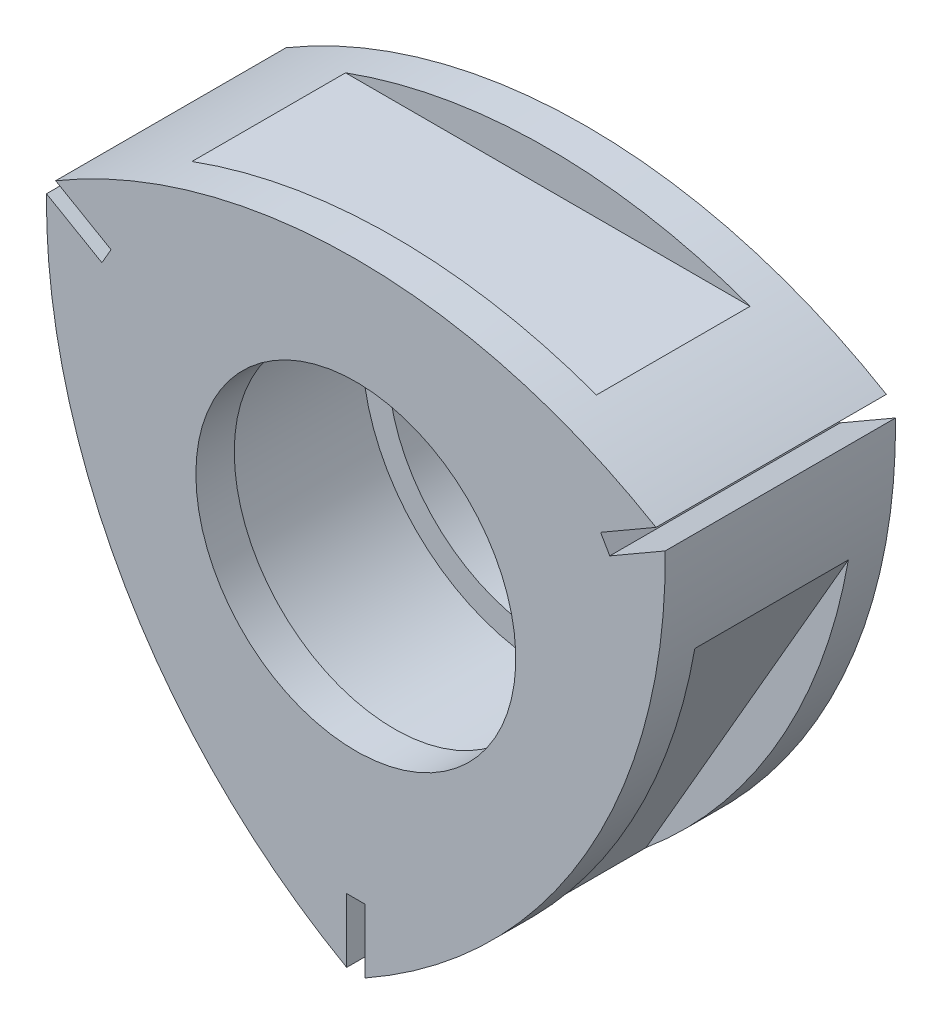
ISO-10303-21;
HEADER;
FILE_DESCRIPTION(('STEP AP214'),'2;1');
FILE_NAME('part.step','',(''),(''),'','','');
FILE_SCHEMA(('AUTOMOTIVE_DESIGN { 1 0 10303 214 1 1 1 1 }'));
ENDSEC;
DATA;
#1=APPLICATION_CONTEXT('core data for automotive mechanical design processes');
#2=APPLICATION_PROTOCOL_DEFINITION('international standard','automotive_design',2000,#1);
#3=PRODUCT_CONTEXT('',#1,'mechanical');
#4=PRODUCT('Part','Part','',(#3));
#5=PRODUCT_RELATED_PRODUCT_CATEGORY('part','',(#4));
#6=PRODUCT_DEFINITION_FORMATION('','',#4);
#7=PRODUCT_DEFINITION_CONTEXT('part definition',#1,'design');
#8=PRODUCT_DEFINITION('design','',#6,#7);
#9=PRODUCT_DEFINITION_SHAPE('','',#8);
#10=(LENGTH_UNIT() NAMED_UNIT(*) SI_UNIT(.MILLI.,.METRE.));
#11=(NAMED_UNIT(*) PLANE_ANGLE_UNIT() SI_UNIT($,.RADIAN.));
#12=(NAMED_UNIT(*) SI_UNIT($,.STERADIAN.) SOLID_ANGLE_UNIT());
#13=UNCERTAINTY_MEASURE_WITH_UNIT(LENGTH_MEASURE(1.E-05),#10,'distance_accuracy_value','');
#14=(GEOMETRIC_REPRESENTATION_CONTEXT(3) GLOBAL_UNCERTAINTY_ASSIGNED_CONTEXT((#13)) GLOBAL_UNIT_ASSIGNED_CONTEXT((#10,
#11,#12)) REPRESENTATION_CONTEXT('',''));
#15=CARTESIAN_POINT('',(0.,0.,0.));
#16=DIRECTION('',(0.,0.,1.));
#17=DIRECTION('',(1.,0.,0.));
#18=AXIS2_PLACEMENT_3D('',#15,#16,#17);
#19=CARTESIAN_POINT('',(-21.8238401753678,12.5999999999999,18.));
#20=DIRECTION('',(0.,0.,1.));
#21=DIRECTION('',(1.,0.,0.));
#22=AXIS2_PLACEMENT_3D('',#19,#20,#21);
#23=PLANE('',#22);
#24=CARTESIAN_POINT('',(-21.8238401753678,12.5999999999999,18.));
#25=DIRECTION('',(0.,0.,1.));
#26=DIRECTION('',(1.,0.,0.));
#27=AXIS2_PLACEMENT_3D('',#24,#25,#26);
#28=CIRCLE('',#27,45.9999999999999);
#29=CARTESIAN_POINT('',(0.71479332358234,-27.5,18.));
#30=VERTEX_POINT('',#29);
#31=CARTESIAN_POINT('',(24.1730952658632,13.1309708233222,18.));
#32=VERTEX_POINT('',#31);
#33=EDGE_CURVE('E249',#30,#32,#28,.T.);
#34=ORIENTED_EDGE('',*,*,#33,.T.);
#35=DIRECTION('',(-0.866025403784425,-0.500000000000023,0.));
#36=VECTOR('',#35,1.);
#37=CARTESIAN_POINT('',(24.1730952658632,13.1309708233222,18.));
#38=LINE('',#37,#36);
#39=CARTESIAN_POINT('',(19.8429682469412,10.6309708233221,18.));
#40=VERTEX_POINT('',#39);
#41=EDGE_CURVE('E247',#32,#40,#38,.T.);
#42=ORIENTED_EDGE('',*,*,#41,.T.);
#43=DIRECTION('',(-0.500000000000077,0.866025403784395,0.));
#44=VECTOR('',#43,1.);
#45=CARTESIAN_POINT('',(19.4855715851499,11.25,18.));
#46=LINE('',#45,#44);
#47=CARTESIAN_POINT('',(19.1281749233587,11.8690291766778,18.));
#48=VERTEX_POINT('',#47);
#49=EDGE_CURVE('E245',#40,#48,#46,.T.);
#50=ORIENTED_EDGE('',*,*,#49,.T.);
#51=DIRECTION('',(0.866025403784439,0.499999999999999,0.));
#52=VECTOR('',#51,1.);
#53=CARTESIAN_POINT('',(23.4583019422809,14.3690291766778,18.));
#54=LINE('',#53,#52);
#55=CARTESIAN_POINT('',(23.4583019422809,14.3690291766778,18.));
#56=VERTEX_POINT('',#55);
#57=EDGE_CURVE('E243',#48,#56,#54,.T.);
#58=ORIENTED_EDGE('',*,*,#57,.T.);
#59=CARTESIAN_POINT('',(0.,-25.2,18.));
#60=DIRECTION('',(0.,0.,1.));
#61=DIRECTION('',(1.,0.,0.));
#62=AXIS2_PLACEMENT_3D('',#59,#60,#61);
#63=CIRCLE('',#62,46.);
#64=CARTESIAN_POINT('',(-23.4583019422809,14.3690291766778,18.));
#65=VERTEX_POINT('',#64);
#66=EDGE_CURVE('E241',#56,#65,#63,.T.);
#67=ORIENTED_EDGE('',*,*,#66,.T.);
#68=DIRECTION('',(0.866025403784438,-0.500000000000002,0.));
#69=VECTOR('',#68,1.);
#70=CARTESIAN_POINT('',(-23.4583019422809,14.3690291766778,18.));
#71=LINE('',#70,#69);
#72=CARTESIAN_POINT('',(-19.1281749233587,11.8690291766778,18.));
#73=VERTEX_POINT('',#72);
#74=EDGE_CURVE('E239',#65,#73,#71,.T.);
#75=ORIENTED_EDGE('',*,*,#74,.T.);
#76=DIRECTION('',(-0.499999999999994,-0.866025403784442,0.));
#77=VECTOR('',#76,1.);
#78=CARTESIAN_POINT('',(-19.4855715833587,11.2500000031024,18.));
#79=LINE('',#78,#77);
#80=CARTESIAN_POINT('',(-19.842968246941,10.6309708233222,18.));
#81=VERTEX_POINT('',#80);
#82=EDGE_CURVE('E237',#73,#81,#79,.T.);
#83=ORIENTED_EDGE('',*,*,#82,.T.);
#84=DIRECTION('',(-0.866025403784439,0.499999999999999,0.));
#85=VECTOR('',#84,1.);
#86=CARTESIAN_POINT('',(-22.181236837159,11.9809708233223,18.));
#87=LINE('',#86,#85);
#88=CARTESIAN_POINT('',(-24.1730952658632,13.1309708233222,18.));
#89=VERTEX_POINT('',#88);
#90=EDGE_CURVE('E235',#81,#89,#87,.T.);
#91=ORIENTED_EDGE('',*,*,#90,.T.);
#92=CARTESIAN_POINT('',(21.8238401753676,12.6,18.));
#93=DIRECTION('',(0.,0.,1.));
#94=DIRECTION('',(-1.,0.,0.));
#95=AXIS2_PLACEMENT_3D('',#92,#93,#94);
#96=CIRCLE('',#95,45.9999999999997);
#97=CARTESIAN_POINT('',(-0.714793323582361,-27.5,18.));
#98=VERTEX_POINT('',#97);
#99=EDGE_CURVE('E233',#89,#98,#96,.T.);
#100=ORIENTED_EDGE('',*,*,#99,.T.);
#101=DIRECTION('',(0.,1.,0.));
#102=VECTOR('',#101,1.);
#103=CARTESIAN_POINT('',(-0.714793323582361,-27.5,18.));
#104=LINE('',#103,#102);
#105=CARTESIAN_POINT('',(-0.714793323582339,-22.5,18.));
#106=VERTEX_POINT('',#105);
#107=EDGE_CURVE('E231',#98,#106,#104,.T.);
#108=ORIENTED_EDGE('',*,*,#107,.T.);
#109=DIRECTION('',(1.,0.,0.));
#110=VECTOR('',#109,1.);
#111=CARTESIAN_POINT('',(0.,-22.5,18.));
#112=LINE('',#111,#110);
#113=CARTESIAN_POINT('',(0.714793323582348,-22.5,18.));
#114=VERTEX_POINT('',#113);
#115=EDGE_CURVE('E229',#106,#114,#112,.T.);
#116=ORIENTED_EDGE('',*,*,#115,.T.);
#117=DIRECTION('',(0.,-1.,0.));
#118=VECTOR('',#117,1.);
#119=CARTESIAN_POINT('',(0.71479332358234,-27.5,18.));
#120=LINE('',#119,#118);
#121=EDGE_CURVE('E227',#114,#30,#120,.T.);
#122=ORIENTED_EDGE('',*,*,#121,.T.);
#123=EDGE_LOOP('',(#34,#42,#50,#58,#67,#75,#83,#91,#100,#108,#116,#122));
#124=FACE_BOUND('',#123,.T.);
#125=CARTESIAN_POINT('',(0.,0.,18.));
#126=DIRECTION('',(0.,0.,-1.));
#127=DIRECTION('',(-1.,0.,0.));
#128=AXIS2_PLACEMENT_3D('',#125,#126,#127);
#129=CIRCLE('',#128,12.5);
#130=CARTESIAN_POINT('',(-12.5,0.,18.));
#131=VERTEX_POINT('',#130);
#132=EDGE_CURVE('E305',#131,#131,#129,.T.);
#133=ORIENTED_EDGE('',*,*,#132,.T.);
#134=EDGE_LOOP('',(#133));
#135=FACE_BOUND('',#134,.T.);
#136=ADVANCED_FACE('F26',(#124,#135),#23,.T.);
#137=CARTESIAN_POINT('',(-21.8238401753678,12.5999999999999,0.));
#138=DIRECTION('',(0.,0.,1.));
#139=DIRECTION('',(1.,0.,0.));
#140=AXIS2_PLACEMENT_3D('',#137,#138,#139);
#141=PLANE('',#140);
#142=CARTESIAN_POINT('',(-21.8238401753679,12.6,0.));
#143=DIRECTION('',(0.,0.,1.));
#144=DIRECTION('',(1.,0.,0.));
#145=AXIS2_PLACEMENT_3D('',#142,#143,#144);
#146=CIRCLE('',#145,46.);
#147=CARTESIAN_POINT('',(0.71479332358234,-27.5,0.));
#148=VERTEX_POINT('',#147);
#149=CARTESIAN_POINT('',(24.1730952658632,13.1309708233222,0.));
#150=VERTEX_POINT('',#149);
#151=EDGE_CURVE('E281',#148,#150,#146,.T.);
#152=ORIENTED_EDGE('',*,*,#151,.F.);
#153=DIRECTION('',(0.,-1.,0.));
#154=VECTOR('',#153,1.);
#155=CARTESIAN_POINT('',(0.71479332358234,-27.5,0.));
#156=LINE('',#155,#154);
#157=CARTESIAN_POINT('',(0.714793323582348,-22.5,0.));
#158=VERTEX_POINT('',#157);
#159=EDGE_CURVE('E251',#158,#148,#156,.T.);
#160=ORIENTED_EDGE('',*,*,#159,.F.);
#161=DIRECTION('',(1.,0.,0.));
#162=VECTOR('',#161,1.);
#163=CARTESIAN_POINT('',(0.,-22.5,0.));
#164=LINE('',#163,#162);
#165=CARTESIAN_POINT('',(-0.714793323582339,-22.5,0.));
#166=VERTEX_POINT('',#165);
#167=EDGE_CURVE('E254',#166,#158,#164,.T.);
#168=ORIENTED_EDGE('',*,*,#167,.F.);
#169=DIRECTION('',(0.,1.,0.));
#170=VECTOR('',#169,1.);
#171=CARTESIAN_POINT('',(-0.714793323582361,-27.5,0.));
#172=LINE('',#171,#170);
#173=CARTESIAN_POINT('',(-0.714793323582361,-27.5,0.));
#174=VERTEX_POINT('',#173);
#175=EDGE_CURVE('E256',#174,#166,#172,.T.);
#176=ORIENTED_EDGE('',*,*,#175,.F.);
#177=CARTESIAN_POINT('',(21.8238401753679,12.6,0.));
#178=DIRECTION('',(0.,0.,1.));
#179=DIRECTION('',(1.,0.,0.));
#180=AXIS2_PLACEMENT_3D('',#177,#178,#179);
#181=CIRCLE('',#180,46.);
#182=CARTESIAN_POINT('',(-24.1730952658632,13.1309708233222,0.));
#183=VERTEX_POINT('',#182);
#184=EDGE_CURVE('E259',#183,#174,#181,.T.);
#185=ORIENTED_EDGE('',*,*,#184,.F.);
#186=DIRECTION('',(-0.86602540378444,0.499999999999997,0.));
#187=VECTOR('',#186,1.);
#188=CARTESIAN_POINT('',(-24.1730952658632,13.1309708233222,0.));
#189=LINE('',#188,#187);
#190=CARTESIAN_POINT('',(-19.842968246941,10.6309708233222,0.));
#191=VERTEX_POINT('',#190);
#192=EDGE_CURVE('E261',#191,#183,#189,.T.);
#193=ORIENTED_EDGE('',*,*,#192,.F.);
#194=DIRECTION('',(-0.5,-0.866025403784439,0.));
#195=VECTOR('',#194,1.);
#196=CARTESIAN_POINT('',(-19.4855715833587,11.2500000031024,0.));
#197=LINE('',#196,#195);
#198=CARTESIAN_POINT('',(-19.1281749233587,11.8690291766778,0.));
#199=VERTEX_POINT('',#198);
#200=EDGE_CURVE('E264',#199,#191,#197,.T.);
#201=ORIENTED_EDGE('',*,*,#200,.F.);
#202=DIRECTION('',(0.866025403784439,-0.499999999999999,0.));
#203=VECTOR('',#202,1.);
#204=CARTESIAN_POINT('',(-21.4664435135765,13.2190291766777,0.));
#205=LINE('',#204,#203);
#206=CARTESIAN_POINT('',(-23.4583019422809,14.3690291766778,0.));
#207=VERTEX_POINT('',#206);
#208=EDGE_CURVE('E267',#207,#199,#205,.T.);
#209=ORIENTED_EDGE('',*,*,#208,.F.);
#210=CARTESIAN_POINT('',(0.,-25.2,0.));
#211=DIRECTION('',(0.,0.,1.));
#212=DIRECTION('',(1.,0.,0.));
#213=AXIS2_PLACEMENT_3D('',#210,#211,#212);
#214=CIRCLE('',#213,46.);
#215=CARTESIAN_POINT('',(23.4583019422809,14.3690291766778,0.));
#216=VERTEX_POINT('',#215);
#217=EDGE_CURVE('E270',#216,#207,#214,.T.);
#218=ORIENTED_EDGE('',*,*,#217,.F.);
#219=DIRECTION('',(0.866025403784439,0.499999999999999,0.));
#220=VECTOR('',#219,1.);
#221=CARTESIAN_POINT('',(23.4583019422809,14.3690291766778,0.));
#222=LINE('',#221,#220);
#223=CARTESIAN_POINT('',(19.1281749233587,11.8690291766778,0.));
#224=VERTEX_POINT('',#223);
#225=EDGE_CURVE('E273',#224,#216,#222,.T.);
#226=ORIENTED_EDGE('',*,*,#225,.F.);
#227=DIRECTION('',(-0.49999999999999,0.866025403784445,0.));
#228=VECTOR('',#227,1.);
#229=CARTESIAN_POINT('',(19.4855715851499,11.25,0.));
#230=LINE('',#229,#228);
#231=CARTESIAN_POINT('',(19.8429682469412,10.6309708233221,0.));
#232=VERTEX_POINT('',#231);
#233=EDGE_CURVE('E276',#232,#224,#230,.T.);
#234=ORIENTED_EDGE('',*,*,#233,.F.);
#235=DIRECTION('',(-0.866025403784425,-0.500000000000023,0.));
#236=VECTOR('',#235,1.);
#237=CARTESIAN_POINT('',(24.1730952658632,13.1309708233222,0.));
#238=LINE('',#237,#236);
#239=EDGE_CURVE('E278',#150,#232,#238,.T.);
#240=ORIENTED_EDGE('',*,*,#239,.F.);
#241=EDGE_LOOP('',(#152,#160,#168,#176,#185,#193,#201,#209,#218,#226,#234,#240));
#242=FACE_BOUND('',#241,.T.);
#243=CARTESIAN_POINT('',(0.,0.,0.));
#244=DIRECTION('',(0.,0.,-1.));
#245=DIRECTION('',(-1.,0.,0.));
#246=AXIS2_PLACEMENT_3D('',#243,#244,#245);
#247=CIRCLE('',#246,12.5);
#248=CARTESIAN_POINT('',(-12.5,0.,0.));
#249=VERTEX_POINT('',#248);
#250=EDGE_CURVE('E302',#249,#249,#247,.T.);
#251=ORIENTED_EDGE('',*,*,#250,.F.);
#252=EDGE_LOOP('',(#251));
#253=FACE_BOUND('',#252,.T.);
#254=ADVANCED_FACE('F327',(#242,#253),#141,.F.);
#255=CARTESIAN_POINT('',(-21.8238401753679,12.6,18.));
#256=DIRECTION('',(0.,0.,-1.));
#257=DIRECTION('',(-1.,0.,0.));
#258=AXIS2_PLACEMENT_3D('',#255,#256,#257);
#259=CYLINDRICAL_SURFACE('',#258,46.);
#260=ORIENTED_EDGE('',*,*,#151,.T.);
#261=DIRECTION('',(0.,0.,-1.));
#262=VECTOR('',#261,1.);
#263=CARTESIAN_POINT('',(24.1730952658632,13.1309708233222,18.));
#264=LINE('',#263,#262);
#265=EDGE_CURVE('E191',#32,#150,#264,.T.);
#266=ORIENTED_EDGE('',*,*,#265,.F.);
#267=ORIENTED_EDGE('',*,*,#33,.F.);
#268=DIRECTION('',(0.,0.,-1.));
#269=VECTOR('',#268,1.);
#270=CARTESIAN_POINT('',(0.71479332358234,-27.5,18.));
#271=LINE('',#270,#269);
#272=EDGE_CURVE('E224',#30,#148,#271,.T.);
#273=ORIENTED_EDGE('',*,*,#272,.T.);
#274=EDGE_LOOP('',(#260,#266,#267,#273));
#275=FACE_BOUND('',#274,.T.);
#276=CARTESIAN_POINT('',(-21.8238401753679,12.6,15.));
#277=DIRECTION('',(0.,0.,-1.));
#278=DIRECTION('',(-1.,0.,0.));
#279=AXIS2_PLACEMENT_3D('',#276,#277,#278);
#280=CIRCLE('',#279,46.);
#281=CARTESIAN_POINT('',(23.4903557741752,4.68648968874024,15.));
#282=VERTEX_POINT('',#281);
#283=CARTESIAN_POINT('',(7.68655876206435,-22.6864896887407,15.));
#284=VERTEX_POINT('',#283);
#285=EDGE_CURVE('E156',#282,#284,#280,.T.);
#286=ORIENTED_EDGE('',*,*,#285,.F.);
#287=DIRECTION('',(0.,0.,-1.));
#288=VECTOR('',#287,1.);
#289=CARTESIAN_POINT('',(23.4903557741752,4.68648968874026,18.));
#290=LINE('',#289,#288);
#291=CARTESIAN_POINT('',(23.4903557741752,4.68648968874026,3.));
#292=VERTEX_POINT('',#291);
#293=EDGE_CURVE('E171',#282,#292,#290,.T.);
#294=ORIENTED_EDGE('',*,*,#293,.T.);
#295=CARTESIAN_POINT('',(-21.8238401753679,12.6,3.));
#296=DIRECTION('',(0.,0.,-1.));
#297=DIRECTION('',(-1.,0.,0.));
#298=AXIS2_PLACEMENT_3D('',#295,#296,#297);
#299=CIRCLE('',#298,46.);
#300=CARTESIAN_POINT('',(7.68655876206433,-22.6864896887407,3.));
#301=VERTEX_POINT('',#300);
#302=EDGE_CURVE('E177',#292,#301,#299,.T.);
#303=ORIENTED_EDGE('',*,*,#302,.T.);
#304=DIRECTION('',(0.,0.,-1.));
#305=VECTOR('',#304,1.);
#306=CARTESIAN_POINT('',(7.68655876206433,-22.6864896887407,18.));
#307=LINE('',#306,#305);
#308=EDGE_CURVE('E174',#301,#284,#307,.F.);
#309=ORIENTED_EDGE('',*,*,#308,.T.);
#310=EDGE_LOOP('',(#286,#294,#303,#309));
#311=FACE_BOUND('',#310,.T.);
#312=ADVANCED_FACE('F28',(#275,#311),#259,.T.);
#313=CARTESIAN_POINT('',(0.,-25.2,18.));
#314=DIRECTION('',(0.,0.,-1.));
#315=DIRECTION('',(-1.,0.,0.));
#316=AXIS2_PLACEMENT_3D('',#313,#314,#315);
#317=CYLINDRICAL_SURFACE('',#316,46.);
#318=ORIENTED_EDGE('',*,*,#217,.T.);
#319=DIRECTION('',(0.,0.,-1.));
#320=VECTOR('',#319,1.);
#321=CARTESIAN_POINT('',(-23.4583019422809,14.3690291766778,18.));
#322=LINE('',#321,#320);
#323=EDGE_CURVE('E203',#65,#207,#322,.T.);
#324=ORIENTED_EDGE('',*,*,#323,.F.);
#325=ORIENTED_EDGE('',*,*,#66,.F.);
#326=DIRECTION('',(0.,0.,-1.));
#327=VECTOR('',#326,1.);
#328=CARTESIAN_POINT('',(23.4583019422809,14.3690291766778,18.));
#329=LINE('',#328,#327);
#330=EDGE_CURVE('E200',#56,#216,#329,.T.);
#331=ORIENTED_EDGE('',*,*,#330,.T.);
#332=EDGE_LOOP('',(#318,#324,#325,#331));
#333=FACE_BOUND('',#332,.T.);
#334=CARTESIAN_POINT('',(0.,-25.2,15.));
#335=DIRECTION('',(0.,0.,-1.));
#336=DIRECTION('',(-1.,0.,0.));
#337=AXIS2_PLACEMENT_3D('',#334,#335,#336);
#338=CIRCLE('',#337,46.);
#339=CARTESIAN_POINT('',(-15.8037970121107,18.,15.));
#340=VERTEX_POINT('',#339);
#341=CARTESIAN_POINT('',(15.8037970121107,18.,15.));
#342=VERTEX_POINT('',#341);
#343=EDGE_CURVE('E180',#340,#342,#338,.T.);
#344=ORIENTED_EDGE('',*,*,#343,.F.);
#345=DIRECTION('',(0.,0.,-1.));
#346=VECTOR('',#345,1.);
#347=CARTESIAN_POINT('',(-15.8037970121107,18.,18.));
#348=LINE('',#347,#346);
#349=CARTESIAN_POINT('',(-15.8037970121107,18.,3.));
#350=VERTEX_POINT('',#349);
#351=EDGE_CURVE('E182',#340,#350,#348,.T.);
#352=ORIENTED_EDGE('',*,*,#351,.T.);
#353=CARTESIAN_POINT('',(0.,-25.2,3.));
#354=DIRECTION('',(0.,0.,-1.));
#355=DIRECTION('',(-1.,0.,0.));
#356=AXIS2_PLACEMENT_3D('',#353,#354,#355);
#357=CIRCLE('',#356,46.);
#358=CARTESIAN_POINT('',(15.8037970121107,18.,3.));
#359=VERTEX_POINT('',#358);
#360=EDGE_CURVE('E188',#350,#359,#357,.T.);
#361=ORIENTED_EDGE('',*,*,#360,.T.);
#362=DIRECTION('',(0.,0.,-1.));
#363=VECTOR('',#362,1.);
#364=CARTESIAN_POINT('',(15.8037970121107,18.,18.));
#365=LINE('',#364,#363);
#366=EDGE_CURVE('E185',#359,#342,#365,.F.);
#367=ORIENTED_EDGE('',*,*,#366,.T.);
#368=EDGE_LOOP('',(#344,#352,#361,#367));
#369=FACE_BOUND('',#368,.T.);
#370=ADVANCED_FACE('F366',(#333,#369),#317,.T.);
#371=CARTESIAN_POINT('',(24.1730952658632,13.1309708233222,18.));
#372=DIRECTION('',(0.500000000000023,-0.866025403784425,0.));
#373=DIRECTION('',(0.866025403784425,0.500000000000023,0.));
#374=AXIS2_PLACEMENT_3D('',#371,#372,#373);
#375=PLANE('',#374);
#376=ORIENTED_EDGE('',*,*,#239,.T.);
#377=DIRECTION('',(0.,0.,-1.));
#378=VECTOR('',#377,1.);
#379=CARTESIAN_POINT('',(19.8429682469412,10.6309708233221,18.));
#380=LINE('',#379,#378);
#381=EDGE_CURVE('E194',#40,#232,#380,.T.);
#382=ORIENTED_EDGE('',*,*,#381,.F.);
#383=ORIENTED_EDGE('',*,*,#41,.F.);
#384=ORIENTED_EDGE('',*,*,#265,.T.);
#385=EDGE_LOOP('',(#376,#382,#383,#384));
#386=FACE_BOUND('',#385,.T.);
#387=ADVANCED_FACE('F369',(#386),#375,.F.);
#388=CARTESIAN_POINT('',(19.4855715851499,11.25,18.));
#389=DIRECTION('',(-0.866025403784445,-0.49999999999999,0.));
#390=DIRECTION('',(0.49999999999999,-0.866025403784445,0.));
#391=AXIS2_PLACEMENT_3D('',#388,#389,#390);
#392=PLANE('',#391);
#393=ORIENTED_EDGE('',*,*,#233,.T.);
#394=DIRECTION('',(0.,0.,-1.));
#395=VECTOR('',#394,1.);
#396=CARTESIAN_POINT('',(19.1281749233587,11.8690291766778,18.));
#397=LINE('',#396,#395);
#398=EDGE_CURVE('E197',#48,#224,#397,.T.);
#399=ORIENTED_EDGE('',*,*,#398,.F.);
#400=ORIENTED_EDGE('',*,*,#49,.F.);
#401=ORIENTED_EDGE('',*,*,#381,.T.);
#402=EDGE_LOOP('',(#393,#399,#400,#401));
#403=FACE_BOUND('',#402,.T.);
#404=ADVANCED_FACE('F373',(#403),#392,.F.);
#405=CARTESIAN_POINT('',(23.4583019422809,14.3690291766778,18.));
#406=DIRECTION('',(-0.499999999999999,0.866025403784439,0.));
#407=DIRECTION('',(-0.866025403784439,-0.499999999999999,0.));
#408=AXIS2_PLACEMENT_3D('',#405,#406,#407);
#409=PLANE('',#408);
#410=ORIENTED_EDGE('',*,*,#225,.T.);
#411=ORIENTED_EDGE('',*,*,#330,.F.);
#412=ORIENTED_EDGE('',*,*,#57,.F.);
#413=ORIENTED_EDGE('',*,*,#398,.T.);
#414=EDGE_LOOP('',(#410,#411,#412,#413));
#415=FACE_BOUND('',#414,.T.);
#416=ADVANCED_FACE('F364',(#415),#409,.F.);
#417=CARTESIAN_POINT('',(-21.4664435135765,13.2190291766777,18.));
#418=DIRECTION('',(0.499999999999999,0.866025403784439,0.));
#419=DIRECTION('',(-0.866025403784439,0.499999999999999,0.));
#420=AXIS2_PLACEMENT_3D('',#417,#418,#419);
#421=PLANE('',#420);
#422=ORIENTED_EDGE('',*,*,#208,.T.);
#423=DIRECTION('',(0.,0.,-1.));
#424=VECTOR('',#423,1.);
#425=CARTESIAN_POINT('',(-19.1281749233587,11.8690291766778,18.));
#426=LINE('',#425,#424);
#427=EDGE_CURVE('E206',#73,#199,#426,.T.);
#428=ORIENTED_EDGE('',*,*,#427,.F.);
#429=ORIENTED_EDGE('',*,*,#74,.F.);
#430=ORIENTED_EDGE('',*,*,#323,.T.);
#431=EDGE_LOOP('',(#422,#428,#429,#430));
#432=FACE_BOUND('',#431,.T.);
#433=ADVANCED_FACE('F360',(#432),#421,.F.);
#434=CARTESIAN_POINT('',(-19.4855715833587,11.2500000031024,18.));
#435=DIRECTION('',(0.866025403784439,-0.5,0.));
#436=DIRECTION('',(0.5,0.866025403784439,0.));
#437=AXIS2_PLACEMENT_3D('',#434,#435,#436);
#438=PLANE('',#437);
#439=ORIENTED_EDGE('',*,*,#200,.T.);
#440=DIRECTION('',(0.,0.,-1.));
#441=VECTOR('',#440,1.);
#442=CARTESIAN_POINT('',(-19.842968246941,10.6309708233222,18.));
#443=LINE('',#442,#441);
#444=EDGE_CURVE('E209',#81,#191,#443,.T.);
#445=ORIENTED_EDGE('',*,*,#444,.F.);
#446=ORIENTED_EDGE('',*,*,#82,.F.);
#447=ORIENTED_EDGE('',*,*,#427,.T.);
#448=EDGE_LOOP('',(#439,#445,#446,#447));
#449=FACE_BOUND('',#448,.T.);
#450=ADVANCED_FACE('F356',(#449),#438,.F.);
#451=CARTESIAN_POINT('',(-24.1730952658632,13.1309708233222,18.));
#452=DIRECTION('',(-0.499999999999997,-0.86602540378444,0.));
#453=DIRECTION('',(0.86602540378444,-0.499999999999997,0.));
#454=AXIS2_PLACEMENT_3D('',#451,#452,#453);
#455=PLANE('',#454);
#456=ORIENTED_EDGE('',*,*,#192,.T.);
#457=DIRECTION('',(0.,0.,-1.));
#458=VECTOR('',#457,1.);
#459=CARTESIAN_POINT('',(-24.1730952658632,13.1309708233222,18.));
#460=LINE('',#459,#458);
#461=EDGE_CURVE('E212',#89,#183,#460,.T.);
#462=ORIENTED_EDGE('',*,*,#461,.F.);
#463=ORIENTED_EDGE('',*,*,#90,.F.);
#464=ORIENTED_EDGE('',*,*,#444,.T.);
#465=EDGE_LOOP('',(#456,#462,#463,#464));
#466=FACE_BOUND('',#465,.T.);
#467=ADVANCED_FACE('F353',(#466),#455,.F.);
#468=CARTESIAN_POINT('',(21.8238401753679,12.6,18.));
#469=DIRECTION('',(0.,0.,-1.));
#470=DIRECTION('',(-1.,0.,0.));
#471=AXIS2_PLACEMENT_3D('',#468,#469,#470);
#472=CYLINDRICAL_SURFACE('',#471,46.);
#473=DIRECTION('',(0.,0.,-1.));
#474=VECTOR('',#473,1.);
#475=CARTESIAN_POINT('',(-23.4903557741752,4.68648968874027,18.));
#476=LINE('',#475,#474);
#477=CARTESIAN_POINT('',(-23.4903557741752,4.68648968874027,3.));
#478=VERTEX_POINT('',#477);
#479=CARTESIAN_POINT('',(-23.4903557741752,4.6864896887403,15.));
#480=VERTEX_POINT('',#479);
#481=EDGE_CURVE('E155',#478,#480,#476,.F.);
#482=ORIENTED_EDGE('',*,*,#481,.T.);
#483=CARTESIAN_POINT('',(21.8238401753679,12.6,15.));
#484=DIRECTION('',(0.,0.,1.));
#485=DIRECTION('',(1.,0.,0.));
#486=AXIS2_PLACEMENT_3D('',#483,#484,#485);
#487=CIRCLE('',#486,46.);
#488=CARTESIAN_POINT('',(-7.68655876206437,-22.6864896887406,15.));
#489=VERTEX_POINT('',#488);
#490=EDGE_CURVE('E11',#480,#489,#487,.T.);
#491=ORIENTED_EDGE('',*,*,#490,.T.);
#492=DIRECTION('',(0.,0.,-1.));
#493=VECTOR('',#492,1.);
#494=CARTESIAN_POINT('',(-7.68655876206438,-22.6864896887406,18.));
#495=LINE('',#494,#493);
#496=CARTESIAN_POINT('',(-7.68655876206439,-22.6864896887406,3.));
#497=VERTEX_POINT('',#496);
#498=EDGE_CURVE('E35',#489,#497,#495,.T.);
#499=ORIENTED_EDGE('',*,*,#498,.T.);
#500=CARTESIAN_POINT('',(21.8238401753679,12.6,3.));
#501=DIRECTION('',(0.,0.,1.));
#502=DIRECTION('',(1.,0.,0.));
#503=AXIS2_PLACEMENT_3D('',#500,#501,#502);
#504=CIRCLE('',#503,46.);
#505=EDGE_CURVE('E150',#478,#497,#504,.T.);
#506=ORIENTED_EDGE('',*,*,#505,.F.);
#507=EDGE_LOOP('',(#482,#491,#499,#506));
#508=FACE_BOUND('',#507,.T.);
#509=ORIENTED_EDGE('',*,*,#184,.T.);
#510=DIRECTION('',(0.,0.,-1.));
#511=VECTOR('',#510,1.);
#512=CARTESIAN_POINT('',(-0.714793323582361,-27.5,18.));
#513=LINE('',#512,#511);
#514=EDGE_CURVE('E215',#98,#174,#513,.T.);
#515=ORIENTED_EDGE('',*,*,#514,.F.);
#516=ORIENTED_EDGE('',*,*,#99,.F.);
#517=ORIENTED_EDGE('',*,*,#461,.T.);
#518=EDGE_LOOP('',(#509,#515,#516,#517));
#519=FACE_BOUND('',#518,.T.);
#520=ADVANCED_FACE('F165',(#508,#519),#472,.T.);
#521=CARTESIAN_POINT('',(-0.714793323582361,-27.5,18.));
#522=DIRECTION('',(-1.,0.,0.));
#523=DIRECTION('',(0.,-1.,0.));
#524=AXIS2_PLACEMENT_3D('',#521,#522,#523);
#525=PLANE('',#524);
#526=ORIENTED_EDGE('',*,*,#175,.T.);
#527=DIRECTION('',(0.,0.,-1.));
#528=VECTOR('',#527,1.);
#529=CARTESIAN_POINT('',(-0.714793323582339,-22.5,18.));
#530=LINE('',#529,#528);
#531=EDGE_CURVE('E218',#106,#166,#530,.T.);
#532=ORIENTED_EDGE('',*,*,#531,.F.);
#533=ORIENTED_EDGE('',*,*,#107,.F.);
#534=ORIENTED_EDGE('',*,*,#514,.T.);
#535=EDGE_LOOP('',(#526,#532,#533,#534));
#536=FACE_BOUND('',#535,.T.);
#537=ADVANCED_FACE('F346',(#536),#525,.F.);
#538=CARTESIAN_POINT('',(0.,-22.5,18.));
#539=DIRECTION('',(0.,1.,0.));
#540=DIRECTION('',(0.,0.,1.));
#541=AXIS2_PLACEMENT_3D('',#538,#539,#540);
#542=PLANE('',#541);
#543=ORIENTED_EDGE('',*,*,#167,.T.);
#544=DIRECTION('',(0.,0.,-1.));
#545=VECTOR('',#544,1.);
#546=CARTESIAN_POINT('',(0.714793323582348,-22.5,18.));
#547=LINE('',#546,#545);
#548=EDGE_CURVE('E221',#114,#158,#547,.T.);
#549=ORIENTED_EDGE('',*,*,#548,.F.);
#550=ORIENTED_EDGE('',*,*,#115,.F.);
#551=ORIENTED_EDGE('',*,*,#531,.T.);
#552=EDGE_LOOP('',(#543,#549,#550,#551));
#553=FACE_BOUND('',#552,.T.);
#554=ADVANCED_FACE('F342',(#553),#542,.F.);
#555=CARTESIAN_POINT('',(0.71479332358234,-27.5,18.));
#556=DIRECTION('',(1.,0.,0.));
#557=DIRECTION('',(0.,1.,0.));
#558=AXIS2_PLACEMENT_3D('',#555,#556,#557);
#559=PLANE('',#558);
#560=ORIENTED_EDGE('',*,*,#159,.T.);
#561=ORIENTED_EDGE('',*,*,#272,.F.);
#562=ORIENTED_EDGE('',*,*,#121,.F.);
#563=ORIENTED_EDGE('',*,*,#548,.T.);
#564=EDGE_LOOP('',(#560,#561,#562,#563));
#565=FACE_BOUND('',#564,.T.);
#566=ADVANCED_FACE('F338',(#565),#559,.F.);
#567=CARTESIAN_POINT('',(0.,18.,15.));
#568=DIRECTION('',(0.,-1.,0.));
#569=DIRECTION('',(1.,0.,0.));
#570=AXIS2_PLACEMENT_3D('',#567,#568,#569);
#571=PLANE('',#570);
#572=DIRECTION('',(-1.,0.,0.));
#573=VECTOR('',#572,1.);
#574=CARTESIAN_POINT('',(-18.,18.,15.));
#575=LINE('',#574,#573);
#576=EDGE_CURVE('E283',#342,#340,#575,.T.);
#577=ORIENTED_EDGE('',*,*,#576,.F.);
#578=ORIENTED_EDGE('',*,*,#366,.F.);
#579=DIRECTION('',(-1.,0.,0.));
#580=VECTOR('',#579,1.);
#581=CARTESIAN_POINT('',(0.,18.,3.));
#582=LINE('',#581,#580);
#583=EDGE_CURVE('E286',#359,#350,#582,.T.);
#584=ORIENTED_EDGE('',*,*,#583,.T.);
#585=ORIENTED_EDGE('',*,*,#351,.F.);
#586=EDGE_LOOP('',(#577,#578,#584,#585));
#587=FACE_BOUND('',#586,.T.);
#588=ADVANCED_FACE('F341',(#587),#571,.F.);
#589=CARTESIAN_POINT('',(-18.,18.,15.));
#590=DIRECTION('',(0.,0.,-1.));
#591=DIRECTION('',(-1.,0.,0.));
#592=AXIS2_PLACEMENT_3D('',#589,#590,#591);
#593=PLANE('',#592);
#594=ORIENTED_EDGE('',*,*,#343,.T.);
#595=ORIENTED_EDGE('',*,*,#576,.T.);
#596=EDGE_LOOP('',(#594,#595));
#597=FACE_BOUND('',#596,.T.);
#598=ADVANCED_FACE('F417',(#597),#593,.T.);
#599=CARTESIAN_POINT('',(-18.,18.,3.));
#600=DIRECTION('',(0.,0.,-1.));
#601=DIRECTION('',(-1.,0.,0.));
#602=AXIS2_PLACEMENT_3D('',#599,#600,#601);
#603=PLANE('',#602);
#604=ORIENTED_EDGE('',*,*,#583,.F.);
#605=ORIENTED_EDGE('',*,*,#360,.F.);
#606=EDGE_LOOP('',(#604,#605));
#607=FACE_BOUND('',#606,.T.);
#608=ADVANCED_FACE('F420',(#607),#603,.F.);
#609=CARTESIAN_POINT('',(24.5884572681199,6.58845726811978,15.));
#610=DIRECTION('',(-0.866025403784436,0.500000000000004,0.));
#611=DIRECTION('',(-0.500000000000004,-0.866025403784436,0.));
#612=AXIS2_PLACEMENT_3D('',#609,#610,#611);
#613=PLANE('',#612);
#614=DIRECTION('',(0.500000000000004,0.866025403784436,0.));
#615=VECTOR('',#614,1.);
#616=CARTESIAN_POINT('',(15.5884572681199,-9.00000000000008,15.));
#617=LINE('',#616,#615);
#618=EDGE_CURVE('E289',#284,#282,#617,.T.);
#619=ORIENTED_EDGE('',*,*,#618,.F.);
#620=ORIENTED_EDGE('',*,*,#308,.F.);
#621=DIRECTION('',(0.500000000000004,0.866025403784436,0.));
#622=VECTOR('',#621,1.);
#623=CARTESIAN_POINT('',(24.5884572681199,6.58845726811978,3.));
#624=LINE('',#623,#622);
#625=EDGE_CURVE('E48',#301,#292,#624,.T.);
#626=ORIENTED_EDGE('',*,*,#625,.T.);
#627=ORIENTED_EDGE('',*,*,#293,.F.);
#628=EDGE_LOOP('',(#619,#620,#626,#627));
#629=FACE_BOUND('',#628,.T.);
#630=ADVANCED_FACE('F422',(#629),#613,.F.);
#631=CARTESIAN_POINT('',(24.5884572681199,6.58845726811978,15.));
#632=DIRECTION('',(0.,0.,-1.));
#633=DIRECTION('',(-1.,0.,0.));
#634=AXIS2_PLACEMENT_3D('',#631,#632,#633);
#635=PLANE('',#634);
#636=ORIENTED_EDGE('',*,*,#285,.T.);
#637=ORIENTED_EDGE('',*,*,#618,.T.);
#638=EDGE_LOOP('',(#636,#637));
#639=FACE_BOUND('',#638,.T.);
#640=ADVANCED_FACE('F428',(#639),#635,.T.);
#641=CARTESIAN_POINT('',(24.5884572681199,6.58845726811978,3.));
#642=DIRECTION('',(0.,0.,-1.));
#643=DIRECTION('',(-1.,0.,0.));
#644=AXIS2_PLACEMENT_3D('',#641,#642,#643);
#645=PLANE('',#644);
#646=ORIENTED_EDGE('',*,*,#625,.F.);
#647=ORIENTED_EDGE('',*,*,#302,.F.);
#648=EDGE_LOOP('',(#646,#647));
#649=FACE_BOUND('',#648,.T.);
#650=ADVANCED_FACE('F459',(#649),#645,.F.);
#651=CARTESIAN_POINT('',(-6.58845726811979,-24.5884572681199,15.));
#652=DIRECTION('',(0.866025403784436,0.500000000000004,0.));
#653=DIRECTION('',(-0.500000000000004,0.866025403784436,0.));
#654=AXIS2_PLACEMENT_3D('',#651,#652,#653);
#655=PLANE('',#654);
#656=DIRECTION('',(0.500000000000004,-0.866025403784436,0.));
#657=VECTOR('',#656,1.);
#658=CARTESIAN_POINT('',(-15.5884572681199,-9.00000000000008,15.));
#659=LINE('',#658,#657);
#660=EDGE_CURVE('E162',#480,#489,#659,.T.);
#661=ORIENTED_EDGE('',*,*,#660,.F.);
#662=ORIENTED_EDGE('',*,*,#481,.F.);
#663=DIRECTION('',(0.500000000000004,-0.866025403784436,0.));
#664=VECTOR('',#663,1.);
#665=CARTESIAN_POINT('',(-6.58845726811979,-24.5884572681199,3.));
#666=LINE('',#665,#664);
#667=EDGE_CURVE('E41',#478,#497,#666,.T.);
#668=ORIENTED_EDGE('',*,*,#667,.T.);
#669=ORIENTED_EDGE('',*,*,#498,.F.);
#670=EDGE_LOOP('',(#661,#662,#668,#669));
#671=FACE_BOUND('',#670,.T.);
#672=ADVANCED_FACE('F160',(#671),#655,.F.);
#673=CARTESIAN_POINT('',(-24.5884572681199,6.58845726811979,15.));
#674=DIRECTION('',(0.,0.,1.));
#675=DIRECTION('',(1.,0.,0.));
#676=AXIS2_PLACEMENT_3D('',#673,#674,#675);
#677=PLANE('',#676);
#678=ORIENTED_EDGE('',*,*,#660,.T.);
#679=ORIENTED_EDGE('',*,*,#490,.F.);
#680=EDGE_LOOP('',(#678,#679));
#681=FACE_BOUND('',#680,.T.);
#682=ADVANCED_FACE('F472',(#681),#677,.F.);
#683=CARTESIAN_POINT('',(-24.5884572681199,6.58845726811979,3.));
#684=DIRECTION('',(0.,0.,1.));
#685=DIRECTION('',(1.,0.,0.));
#686=AXIS2_PLACEMENT_3D('',#683,#684,#685);
#687=PLANE('',#686);
#688=ORIENTED_EDGE('',*,*,#505,.T.);
#689=ORIENTED_EDGE('',*,*,#667,.F.);
#690=EDGE_LOOP('',(#688,#689));
#691=FACE_BOUND('',#690,.T.);
#692=ADVANCED_FACE('F151',(#691),#687,.T.);
#693=CARTESIAN_POINT('',(0.,0.,0.));
#694=DIRECTION('',(0.,0.,1.));
#695=DIRECTION('',(1.,0.,0.));
#696=AXIS2_PLACEMENT_3D('',#693,#694,#695);
#697=CYLINDRICAL_SURFACE('',#696,12.5);
#698=ORIENTED_EDGE('',*,*,#250,.T.);
#699=EDGE_LOOP('',(#698));
#700=FACE_BOUND('',#699,.T.);
#701=CARTESIAN_POINT('',(0.,0.,3.));
#702=DIRECTION('',(0.,0.,-1.));
#703=DIRECTION('',(-1.,0.,0.));
#704=AXIS2_PLACEMENT_3D('',#701,#702,#703);
#705=CIRCLE('',#704,12.5);
#706=CARTESIAN_POINT('',(-12.5,0.,3.));
#707=VERTEX_POINT('',#706);
#708=EDGE_CURVE('E30',#707,#707,#705,.F.);
#709=ORIENTED_EDGE('',*,*,#708,.T.);
#710=EDGE_LOOP('',(#709));
#711=FACE_BOUND('',#710,.T.);
#712=ADVANCED_FACE('F313',(#700,#711),#697,.F.);
#713=CARTESIAN_POINT('',(0.,0.,15.));
#714=DIRECTION('',(0.,0.,-1.));
#715=DIRECTION('',(-1.,0.,0.));
#716=AXIS2_PLACEMENT_3D('',#713,#714,#715);
#717=CIRCLE('',#716,12.5);
#718=CARTESIAN_POINT('',(-12.5,0.,15.));
#719=VERTEX_POINT('',#718);
#720=EDGE_CURVE('E163',#719,#719,#717,.F.);
#721=ORIENTED_EDGE('',*,*,#720,.F.);
#722=EDGE_LOOP('',(#721));
#723=FACE_BOUND('',#722,.T.);
#724=ORIENTED_EDGE('',*,*,#132,.F.);
#725=EDGE_LOOP('',(#724));
#726=FACE_BOUND('',#725,.T.);
#727=ADVANCED_FACE('F310',(#723,#726),#697,.F.);
#728=CARTESIAN_POINT('',(0.,0.,15.));
#729=DIRECTION('',(0.,0.,-1.));
#730=DIRECTION('',(-1.,0.,0.));
#731=AXIS2_PLACEMENT_3D('',#728,#729,#730);
#732=PLANE('',#731);
#733=CARTESIAN_POINT('',(0.,0.,15.));
#734=DIRECTION('',(0.,0.,-1.));
#735=DIRECTION('',(-1.,0.,0.));
#736=AXIS2_PLACEMENT_3D('',#733,#734,#735);
#737=CIRCLE('',#736,14.5);
#738=CARTESIAN_POINT('',(-14.5,0.,15.));
#739=VERTEX_POINT('',#738);
#740=EDGE_CURVE('E293',#739,#739,#737,.T.);
#741=ORIENTED_EDGE('',*,*,#740,.T.);
#742=EDGE_LOOP('',(#741));
#743=FACE_BOUND('',#742,.T.);
#744=ORIENTED_EDGE('',*,*,#720,.T.);
#745=EDGE_LOOP('',(#744));
#746=FACE_BOUND('',#745,.T.);
#747=ADVANCED_FACE('F312',(#743,#746),#732,.T.);
#748=CARTESIAN_POINT('',(0.,0.,3.));
#749=DIRECTION('',(0.,0.,-1.));
#750=DIRECTION('',(-1.,0.,0.));
#751=AXIS2_PLACEMENT_3D('',#748,#749,#750);
#752=PLANE('',#751);
#753=CARTESIAN_POINT('',(0.,0.,3.));
#754=DIRECTION('',(0.,0.,-1.));
#755=DIRECTION('',(-1.,0.,0.));
#756=AXIS2_PLACEMENT_3D('',#753,#754,#755);
#757=CIRCLE('',#756,14.5);
#758=CARTESIAN_POINT('',(-14.5,0.,3.));
#759=VERTEX_POINT('',#758);
#760=EDGE_CURVE('E296',#759,#759,#757,.T.);
#761=ORIENTED_EDGE('',*,*,#760,.F.);
#762=EDGE_LOOP('',(#761));
#763=FACE_BOUND('',#762,.T.);
#764=ORIENTED_EDGE('',*,*,#708,.F.);
#765=EDGE_LOOP('',(#764));
#766=FACE_BOUND('',#765,.T.);
#767=ADVANCED_FACE('F320',(#763,#766),#752,.F.);
#768=CARTESIAN_POINT('',(0.,0.,15.));
#769=DIRECTION('',(0.,0.,-1.));
#770=DIRECTION('',(-1.,0.,0.));
#771=AXIS2_PLACEMENT_3D('',#768,#769,#770);
#772=CYLINDRICAL_SURFACE('',#771,14.5);
#773=ORIENTED_EDGE('',*,*,#740,.F.);
#774=EDGE_LOOP('',(#773));
#775=FACE_BOUND('',#774,.T.);
#776=ORIENTED_EDGE('',*,*,#760,.T.);
#777=EDGE_LOOP('',(#776));
#778=FACE_BOUND('',#777,.T.);
#779=ADVANCED_FACE('F490',(#775,#778),#772,.F.);
#780=CLOSED_SHELL('',(#136,#254,#312,#370,#387,#404,#416,#433,#450,#467,#520,#537,#554,#566,
#588,#598,#608,#630,#640,#650,#672,#682,#692,#712,#727,#747,#767,#779));
#781=MANIFOLD_SOLID_BREP('B2',#780);
#782=ADVANCED_BREP_SHAPE_REPRESENTATION('',(#18,#781),#14);
#783=SHAPE_DEFINITION_REPRESENTATION(#9,#782);
ENDSEC;
END-ISO-10303-21;
